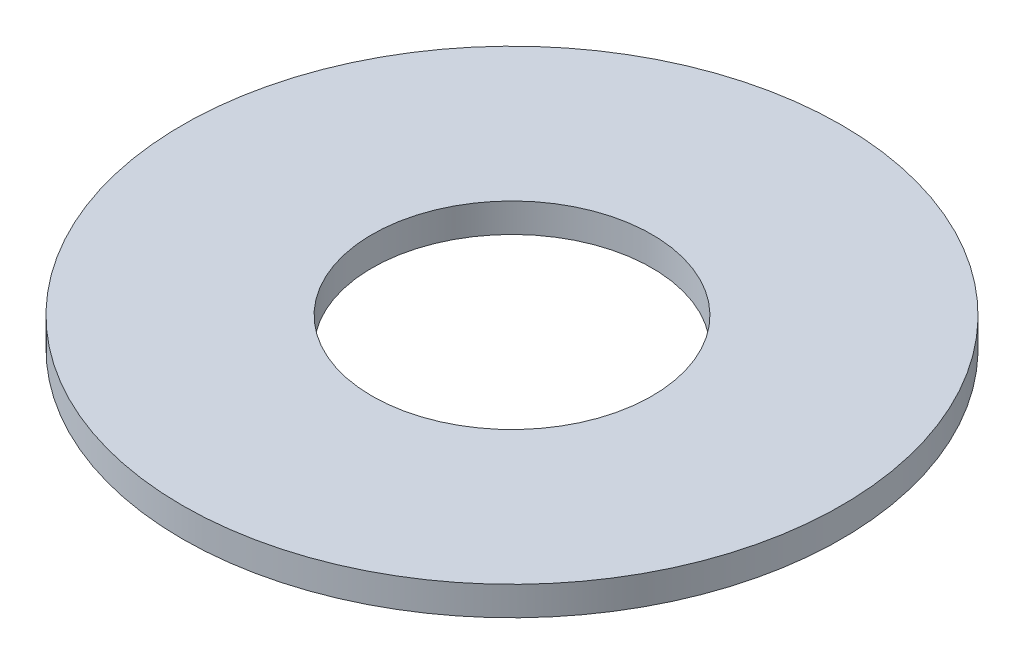
ISO-10303-21;
HEADER;
FILE_DESCRIPTION(('STEP AP214'),'2;1');
FILE_NAME('part.step','',(''),(''),'','','');
FILE_SCHEMA(('AUTOMOTIVE_DESIGN { 1 0 10303 214 1 1 1 1 }'));
ENDSEC;
DATA;
#1=APPLICATION_CONTEXT('core data for automotive mechanical design processes');
#2=APPLICATION_PROTOCOL_DEFINITION('international standard','automotive_design',2000,#1);
#3=PRODUCT_CONTEXT('',#1,'mechanical');
#4=PRODUCT('Part','Part','',(#3));
#5=PRODUCT_RELATED_PRODUCT_CATEGORY('part','',(#4));
#6=PRODUCT_DEFINITION_FORMATION('','',#4);
#7=PRODUCT_DEFINITION_CONTEXT('part definition',#1,'design');
#8=PRODUCT_DEFINITION('design','',#6,#7);
#9=PRODUCT_DEFINITION_SHAPE('','',#8);
#10=(LENGTH_UNIT() NAMED_UNIT(*) SI_UNIT(.MILLI.,.METRE.));
#11=(NAMED_UNIT(*) PLANE_ANGLE_UNIT() SI_UNIT($,.RADIAN.));
#12=(NAMED_UNIT(*) SI_UNIT($,.STERADIAN.) SOLID_ANGLE_UNIT());
#13=UNCERTAINTY_MEASURE_WITH_UNIT(LENGTH_MEASURE(1.E-05),#10,'distance_accuracy_value','');
#14=(GEOMETRIC_REPRESENTATION_CONTEXT(3) GLOBAL_UNCERTAINTY_ASSIGNED_CONTEXT((#13)) GLOBAL_UNIT_ASSIGNED_CONTEXT((#10,
#11,#12)) REPRESENTATION_CONTEXT('',''));
#15=CARTESIAN_POINT('',(0.,0.,0.));
#16=DIRECTION('',(0.,0.,1.));
#17=DIRECTION('',(1.,0.,0.));
#18=AXIS2_PLACEMENT_3D('',#15,#16,#17);
#19=CARTESIAN_POINT('',(0.,1.397,0.));
#20=DIRECTION('',(0.,-1.,0.));
#21=DIRECTION('',(0.,0.,-1.));
#22=AXIS2_PLACEMENT_3D('',#19,#20,#21);
#23=CYLINDRICAL_SURFACE('',#22,15.875);
#24=CARTESIAN_POINT('',(0.,1.397,0.));
#25=DIRECTION('',(0.,1.,0.));
#26=DIRECTION('',(0.,0.,1.));
#27=AXIS2_PLACEMENT_3D('',#24,#25,#26);
#28=CIRCLE('',#27,15.875);
#29=CARTESIAN_POINT('',(0.,1.397,15.875));
#30=VERTEX_POINT('',#29);
#31=EDGE_CURVE('E10',#30,#30,#28,.T.);
#32=ORIENTED_EDGE('',*,*,#31,.F.);
#33=EDGE_LOOP('',(#32));
#34=FACE_BOUND('',#33,.T.);
#35=CARTESIAN_POINT('',(0.,0.,0.));
#36=DIRECTION('',(0.,1.,0.));
#37=DIRECTION('',(0.,0.,1.));
#38=AXIS2_PLACEMENT_3D('',#35,#36,#37);
#39=CIRCLE('',#38,15.875);
#40=CARTESIAN_POINT('',(0.,0.,15.875));
#41=VERTEX_POINT('',#40);
#42=EDGE_CURVE('E33',#41,#41,#39,.T.);
#43=ORIENTED_EDGE('',*,*,#42,.T.);
#44=EDGE_LOOP('',(#43));
#45=FACE_BOUND('',#44,.T.);
#46=ADVANCED_FACE('F30',(#34,#45),#23,.T.);
#47=CARTESIAN_POINT('',(0.,1.397,0.));
#48=DIRECTION('',(0.,1.,0.));
#49=DIRECTION('',(0.,0.,1.));
#50=AXIS2_PLACEMENT_3D('',#47,#48,#49);
#51=PLANE('',#50);
#52=CARTESIAN_POINT('',(0.,1.397,0.));
#53=DIRECTION('',(0.,1.,0.));
#54=DIRECTION('',(0.,0.,1.));
#55=AXIS2_PLACEMENT_3D('',#52,#53,#54);
#56=CIRCLE('',#55,6.7437);
#57=CARTESIAN_POINT('',(0.,1.397,6.7437));
#58=VERTEX_POINT('',#57);
#59=EDGE_CURVE('E42',#58,#58,#56,.T.);
#60=ORIENTED_EDGE('',*,*,#59,.F.);
#61=EDGE_LOOP('',(#60));
#62=FACE_BOUND('',#61,.T.);
#63=ORIENTED_EDGE('',*,*,#31,.T.);
#64=EDGE_LOOP('',(#63));
#65=FACE_BOUND('',#64,.T.);
#66=ADVANCED_FACE('F57',(#62,#65),#51,.T.);
#67=CARTESIAN_POINT('',(0.,0.,0.));
#68=DIRECTION('',(0.,1.,0.));
#69=DIRECTION('',(0.,0.,1.));
#70=AXIS2_PLACEMENT_3D('',#67,#68,#69);
#71=PLANE('',#70);
#72=CARTESIAN_POINT('',(0.,0.,0.));
#73=DIRECTION('',(0.,1.,0.));
#74=DIRECTION('',(0.,0.,1.));
#75=AXIS2_PLACEMENT_3D('',#72,#73,#74);
#76=CIRCLE('',#75,6.7437);
#77=CARTESIAN_POINT('',(0.,0.,6.7437));
#78=VERTEX_POINT('',#77);
#79=EDGE_CURVE('E40',#78,#78,#76,.T.);
#80=ORIENTED_EDGE('',*,*,#79,.T.);
#81=EDGE_LOOP('',(#80));
#82=FACE_BOUND('',#81,.T.);
#83=ORIENTED_EDGE('',*,*,#42,.F.);
#84=EDGE_LOOP('',(#83));
#85=FACE_BOUND('',#84,.T.);
#86=ADVANCED_FACE('F48',(#82,#85),#71,.F.);
#87=CARTESIAN_POINT('',(0.,0.,0.));
#88=DIRECTION('',(0.,1.,0.));
#89=DIRECTION('',(0.,0.,1.));
#90=AXIS2_PLACEMENT_3D('',#87,#88,#89);
#91=CYLINDRICAL_SURFACE('',#90,6.7437);
#92=ORIENTED_EDGE('',*,*,#79,.F.);
#93=EDGE_LOOP('',(#92));
#94=FACE_BOUND('',#93,.T.);
#95=ORIENTED_EDGE('',*,*,#59,.T.);
#96=EDGE_LOOP('',(#95));
#97=FACE_BOUND('',#96,.T.);
#98=ADVANCED_FACE('F51',(#94,#97),#91,.F.);
#99=CLOSED_SHELL('',(#46,#66,#86,#98));
#100=MANIFOLD_SOLID_BREP('B2',#99);
#101=ADVANCED_BREP_SHAPE_REPRESENTATION('',(#18,#100),#14);
#102=SHAPE_DEFINITION_REPRESENTATION(#9,#101);
ENDSEC;
END-ISO-10303-21;
